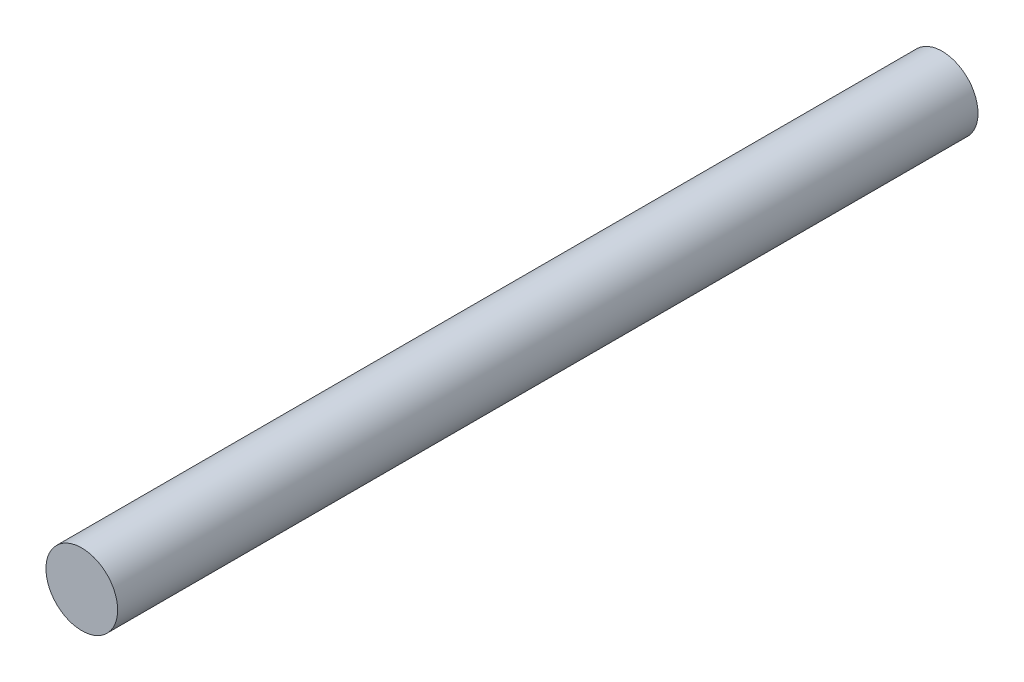
ISO-10303-21;
HEADER;
FILE_DESCRIPTION(('STEP AP214'),'2;1');
FILE_NAME('part.step','',(''),(''),'','','');
FILE_SCHEMA(('AUTOMOTIVE_DESIGN { 1 0 10303 214 1 1 1 1 }'));
ENDSEC;
DATA;
#1=APPLICATION_CONTEXT('core data for automotive mechanical design processes');
#2=APPLICATION_PROTOCOL_DEFINITION('international standard','automotive_design',2000,#1);
#3=PRODUCT_CONTEXT('',#1,'mechanical');
#4=PRODUCT('Part','Part','',(#3));
#5=PRODUCT_RELATED_PRODUCT_CATEGORY('part','',(#4));
#6=PRODUCT_DEFINITION_FORMATION('','',#4);
#7=PRODUCT_DEFINITION_CONTEXT('part definition',#1,'design');
#8=PRODUCT_DEFINITION('design','',#6,#7);
#9=PRODUCT_DEFINITION_SHAPE('','',#8);
#10=(LENGTH_UNIT() NAMED_UNIT(*) SI_UNIT(.MILLI.,.METRE.));
#11=(NAMED_UNIT(*) PLANE_ANGLE_UNIT() SI_UNIT($,.RADIAN.));
#12=(NAMED_UNIT(*) SI_UNIT($,.STERADIAN.) SOLID_ANGLE_UNIT());
#13=UNCERTAINTY_MEASURE_WITH_UNIT(LENGTH_MEASURE(1.E-05),#10,'distance_accuracy_value','');
#14=(GEOMETRIC_REPRESENTATION_CONTEXT(3) GLOBAL_UNCERTAINTY_ASSIGNED_CONTEXT((#13)) GLOBAL_UNIT_ASSIGNED_CONTEXT((#10,
#11,#12)) REPRESENTATION_CONTEXT('',''));
#15=CARTESIAN_POINT('',(0.,0.,0.));
#16=DIRECTION('',(0.,0.,1.));
#17=DIRECTION('',(1.,0.,0.));
#18=AXIS2_PLACEMENT_3D('',#15,#16,#17);
#19=CARTESIAN_POINT('',(0.,0.,300.));
#20=DIRECTION('',(0.,0.,-1.));
#21=DIRECTION('',(-1.,0.,0.));
#22=AXIS2_PLACEMENT_3D('',#19,#20,#21);
#23=CYLINDRICAL_SURFACE('',#22,12.5);
#24=CARTESIAN_POINT('',(0.,0.,300.));
#25=DIRECTION('',(0.,0.,1.));
#26=DIRECTION('',(1.,0.,0.));
#27=AXIS2_PLACEMENT_3D('',#24,#25,#26);
#28=CIRCLE('',#27,12.5);
#29=CARTESIAN_POINT('',(12.5,0.,300.));
#30=VERTEX_POINT('',#29);
#31=EDGE_CURVE('E10',#30,#30,#28,.T.);
#32=ORIENTED_EDGE('',*,*,#31,.F.);
#33=EDGE_LOOP('',(#32));
#34=FACE_BOUND('',#33,.T.);
#35=CARTESIAN_POINT('',(0.,0.,0.));
#36=DIRECTION('',(0.,0.,1.));
#37=DIRECTION('',(1.,0.,0.));
#38=AXIS2_PLACEMENT_3D('',#35,#36,#37);
#39=CIRCLE('',#38,12.5);
#40=CARTESIAN_POINT('',(12.5,0.,0.));
#41=VERTEX_POINT('',#40);
#42=EDGE_CURVE('E40',#41,#41,#39,.T.);
#43=ORIENTED_EDGE('',*,*,#42,.T.);
#44=EDGE_LOOP('',(#43));
#45=FACE_BOUND('',#44,.T.);
#46=ADVANCED_FACE('F37',(#34,#45),#23,.T.);
#47=CARTESIAN_POINT('',(0.,0.,300.));
#48=DIRECTION('',(0.,0.,1.));
#49=DIRECTION('',(1.,0.,0.));
#50=AXIS2_PLACEMENT_3D('',#47,#48,#49);
#51=PLANE('',#50);
#52=ORIENTED_EDGE('',*,*,#31,.T.);
#53=EDGE_LOOP('',(#52));
#54=FACE_BOUND('',#53,.T.);
#55=ADVANCED_FACE('F54',(#54),#51,.T.);
#56=CARTESIAN_POINT('',(0.,0.,0.));
#57=DIRECTION('',(0.,0.,1.));
#58=DIRECTION('',(1.,0.,0.));
#59=AXIS2_PLACEMENT_3D('',#56,#57,#58);
#60=PLANE('',#59);
#61=ORIENTED_EDGE('',*,*,#42,.F.);
#62=EDGE_LOOP('',(#61));
#63=FACE_BOUND('',#62,.T.);
#64=ADVANCED_FACE('F52',(#63),#60,.F.);
#65=CLOSED_SHELL('',(#46,#55,#64));
#66=MANIFOLD_SOLID_BREP('B2',#65);
#67=ADVANCED_BREP_SHAPE_REPRESENTATION('',(#18,#66),#14);
#68=SHAPE_DEFINITION_REPRESENTATION(#9,#67);
ENDSEC;
END-ISO-10303-21;
